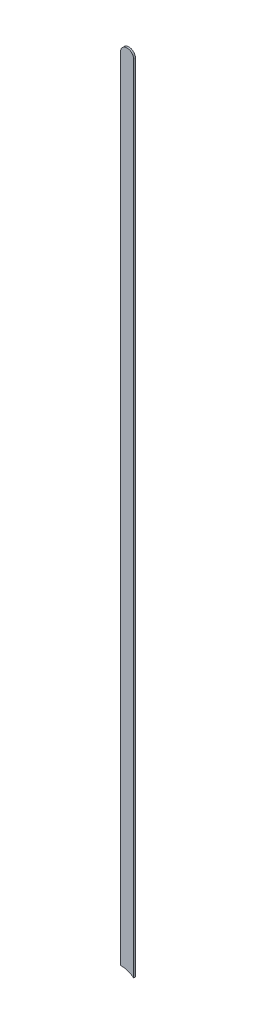
ISO-10303-21;
HEADER;
FILE_DESCRIPTION(('STEP AP214'),'2;1');
FILE_NAME('part.step','',(''),(''),'','','');
FILE_SCHEMA(('AUTOMOTIVE_DESIGN { 1 0 10303 214 1 1 1 1 }'));
ENDSEC;
DATA;
#1=APPLICATION_CONTEXT('core data for automotive mechanical design processes');
#2=APPLICATION_PROTOCOL_DEFINITION('international standard','automotive_design',2000,#1);
#3=PRODUCT_CONTEXT('',#1,'mechanical');
#4=PRODUCT('Part','Part','',(#3));
#5=PRODUCT_RELATED_PRODUCT_CATEGORY('part','',(#4));
#6=PRODUCT_DEFINITION_FORMATION('','',#4);
#7=PRODUCT_DEFINITION_CONTEXT('part definition',#1,'design');
#8=PRODUCT_DEFINITION('design','',#6,#7);
#9=PRODUCT_DEFINITION_SHAPE('','',#8);
#10=(LENGTH_UNIT() NAMED_UNIT(*) SI_UNIT(.MILLI.,.METRE.));
#11=(NAMED_UNIT(*) PLANE_ANGLE_UNIT() SI_UNIT($,.RADIAN.));
#12=(NAMED_UNIT(*) SI_UNIT($,.STERADIAN.) SOLID_ANGLE_UNIT());
#13=UNCERTAINTY_MEASURE_WITH_UNIT(LENGTH_MEASURE(1.E-05),#10,'distance_accuracy_value','');
#14=(GEOMETRIC_REPRESENTATION_CONTEXT(3) GLOBAL_UNCERTAINTY_ASSIGNED_CONTEXT((#13)) GLOBAL_UNIT_ASSIGNED_CONTEXT((#10,
#11,#12)) REPRESENTATION_CONTEXT('',''));
#15=CARTESIAN_POINT('',(0.,0.,0.));
#16=DIRECTION('',(0.,0.,1.));
#17=DIRECTION('',(1.,0.,0.));
#18=AXIS2_PLACEMENT_3D('',#15,#16,#17);
#19=CARTESIAN_POINT('',(87.64598422,72.6590111077274,0.));
#20=DIRECTION('',(-1.,0.,0.));
#21=DIRECTION('',(0.,1.,0.));
#22=AXIS2_PLACEMENT_3D('',#19,#20,#21);
#23=PLANE('',#22);
#24=DIRECTION('',(0.,1.,0.));
#25=VECTOR('',#24,1.);
#26=CARTESIAN_POINT('',(87.64598422,72.4889838,0.03556));
#27=LINE('',#26,#25);
#28=CARTESIAN_POINT('',(87.64598422,72.6590111077274,0.03556));
#29=VERTEX_POINT('',#28);
#30=CARTESIAN_POINT('',(87.64598422,88.05171874,0.03556));
#31=VERTEX_POINT('',#30);
#32=EDGE_CURVE('E11',#29,#31,#27,.T.);
#33=ORIENTED_EDGE('',*,*,#32,.F.);
#34=DIRECTION('',(0.,0.,1.));
#35=VECTOR('',#34,1.);
#36=CARTESIAN_POINT('',(87.64598422,72.6590111077274,0.));
#37=LINE('',#36,#35);
#38=CARTESIAN_POINT('',(87.64598422,72.6590111077274,0.));
#39=VERTEX_POINT('',#38);
#40=EDGE_CURVE('E24',#39,#29,#37,.T.);
#41=ORIENTED_EDGE('',*,*,#40,.F.);
#42=DIRECTION('',(0.,1.,0.));
#43=VECTOR('',#42,1.);
#44=CARTESIAN_POINT('',(87.64598422,72.4889838,0.));
#45=LINE('',#44,#43);
#46=CARTESIAN_POINT('',(87.64598422,88.05171874,0.));
#47=VERTEX_POINT('',#46);
#48=EDGE_CURVE('E75',#39,#47,#45,.T.);
#49=ORIENTED_EDGE('',*,*,#48,.T.);
#50=DIRECTION('',(0.,0.,1.));
#51=VECTOR('',#50,1.);
#52=CARTESIAN_POINT('',(87.64598422,88.05171874,0.));
#53=LINE('',#52,#51);
#54=EDGE_CURVE('E37',#47,#31,#53,.T.);
#55=ORIENTED_EDGE('',*,*,#54,.T.);
#56=EDGE_LOOP('',(#33,#41,#49,#55));
#57=FACE_BOUND('',#56,.T.);
#58=ADVANCED_FACE('F17',(#57),#23,.F.);
#59=CARTESIAN_POINT('',(87.51898422,88.05171874,0.));
#60=DIRECTION('',(0.,0.,-1.));
#61=DIRECTION('',(1.,1.1189649382048E-13,0.));
#62=AXIS2_PLACEMENT_3D('',#59,#60,#61);
#63=CYLINDRICAL_SURFACE('',#62,0.127000000000005);
#64=CARTESIAN_POINT('',(87.51898422,88.05171874,0.03556));
#65=DIRECTION('',(0.,0.,1.));
#66=DIRECTION('',(1.,1.1189649382048E-13,0.));
#67=AXIS2_PLACEMENT_3D('',#64,#65,#66);
#68=CIRCLE('',#67,0.127000000000005);
#69=CARTESIAN_POINT('',(87.39198422,88.05171874,0.03556));
#70=VERTEX_POINT('',#69);
#71=EDGE_CURVE('E83',#31,#70,#68,.T.);
#72=ORIENTED_EDGE('',*,*,#71,.F.);
#73=ORIENTED_EDGE('',*,*,#54,.F.);
#74=CARTESIAN_POINT('',(87.51898422,88.05171874,0.));
#75=DIRECTION('',(0.,0.,1.));
#76=DIRECTION('',(1.,1.1189649382048E-13,0.));
#77=AXIS2_PLACEMENT_3D('',#74,#75,#76);
#78=CIRCLE('',#77,0.127000000000005);
#79=CARTESIAN_POINT('',(87.39198422,88.05171874,0.));
#80=VERTEX_POINT('',#79);
#81=EDGE_CURVE('E81',#47,#80,#78,.T.);
#82=ORIENTED_EDGE('',*,*,#81,.T.);
#83=DIRECTION('',(0.,0.,1.));
#84=VECTOR('',#83,1.);
#85=CARTESIAN_POINT('',(87.39198422,88.05171874,0.));
#86=LINE('',#85,#84);
#87=EDGE_CURVE('E67',#80,#70,#86,.T.);
#88=ORIENTED_EDGE('',*,*,#87,.T.);
#89=EDGE_LOOP('',(#72,#73,#82,#88));
#90=FACE_BOUND('',#89,.T.);
#91=ADVANCED_FACE('F89',(#90),#63,.T.);
#92=CARTESIAN_POINT('',(87.39198422,88.05171874,0.));
#93=DIRECTION('',(1.,0.,0.));
#94=DIRECTION('',(0.,-1.,0.));
#95=AXIS2_PLACEMENT_3D('',#92,#93,#94);
#96=PLANE('',#95);
#97=DIRECTION('',(0.,-1.,0.));
#98=VECTOR('',#97,1.);
#99=CARTESIAN_POINT('',(87.39198422,88.05171874,0.03556));
#100=LINE('',#99,#98);
#101=CARTESIAN_POINT('',(87.39198422,72.7416932439222,0.03556));
#102=VERTEX_POINT('',#101);
#103=EDGE_CURVE('E71',#70,#102,#100,.T.);
#104=ORIENTED_EDGE('',*,*,#103,.F.);
#105=ORIENTED_EDGE('',*,*,#87,.F.);
#106=DIRECTION('',(0.,-1.,0.));
#107=VECTOR('',#106,1.);
#108=CARTESIAN_POINT('',(87.39198422,88.05171874,0.));
#109=LINE('',#108,#107);
#110=CARTESIAN_POINT('',(87.39198422,72.7416932439222,0.));
#111=VERTEX_POINT('',#110);
#112=EDGE_CURVE('E63',#80,#111,#109,.T.);
#113=ORIENTED_EDGE('',*,*,#112,.T.);
#114=DIRECTION('',(0.,0.,1.));
#115=VECTOR('',#114,1.);
#116=CARTESIAN_POINT('',(87.39198422,72.7416932439222,0.));
#117=LINE('',#116,#115);
#118=EDGE_CURVE('E53',#111,#102,#117,.T.);
#119=ORIENTED_EDGE('',*,*,#118,.T.);
#120=EDGE_LOOP('',(#104,#105,#113,#119));
#121=FACE_BOUND('',#120,.T.);
#122=ADVANCED_FACE('F66',(#121),#96,.F.);
#123=CARTESIAN_POINT('',(87.41697274,72.38697232,0.));
#124=DIRECTION('',(0.,0.,-1.));
#125=DIRECTION('',(1.,0.,0.));
#126=AXIS2_PLACEMENT_3D('',#123,#124,#125);
#127=CYLINDRICAL_SURFACE('',#126,0.3556);
#128=ORIENTED_EDGE('',*,*,#40,.T.);
#129=CARTESIAN_POINT('',(87.41697274,72.38697232,0.03556));
#130=DIRECTION('',(0.,0.,1.));
#131=DIRECTION('',(1.,0.,0.));
#132=AXIS2_PLACEMENT_3D('',#129,#130,#131);
#133=CIRCLE('',#132,0.3556);
#134=EDGE_CURVE('E59',#29,#102,#133,.T.);
#135=ORIENTED_EDGE('',*,*,#134,.T.);
#136=ORIENTED_EDGE('',*,*,#118,.F.);
#137=CARTESIAN_POINT('',(87.41697274,72.38697232,0.));
#138=DIRECTION('',(0.,0.,1.));
#139=DIRECTION('',(1.,0.,0.));
#140=AXIS2_PLACEMENT_3D('',#137,#138,#139);
#141=CIRCLE('',#140,0.3556);
#142=EDGE_CURVE('E57',#39,#111,#141,.T.);
#143=ORIENTED_EDGE('',*,*,#142,.F.);
#144=EDGE_LOOP('',(#128,#135,#136,#143));
#145=FACE_BOUND('',#144,.T.);
#146=ADVANCED_FACE('F55',(#145),#127,.F.);
#147=CARTESIAN_POINT('',(87.64598422,72.4889838,0.));
#148=DIRECTION('',(0.,0.,-1.));
#149=DIRECTION('',(-1.,0.,0.));
#150=AXIS2_PLACEMENT_3D('',#147,#148,#149);
#151=PLANE('',#150);
#152=ORIENTED_EDGE('',*,*,#48,.F.);
#153=ORIENTED_EDGE('',*,*,#142,.T.);
#154=ORIENTED_EDGE('',*,*,#112,.F.);
#155=ORIENTED_EDGE('',*,*,#81,.F.);
#156=EDGE_LOOP('',(#152,#153,#154,#155));
#157=FACE_BOUND('',#156,.T.);
#158=ADVANCED_FACE('F74',(#157),#151,.T.);
#159=CARTESIAN_POINT('',(87.64598422,72.4889838,0.03556));
#160=DIRECTION('',(0.,0.,-1.));
#161=DIRECTION('',(-1.,0.,0.));
#162=AXIS2_PLACEMENT_3D('',#159,#160,#161);
#163=PLANE('',#162);
#164=ORIENTED_EDGE('',*,*,#134,.F.);
#165=ORIENTED_EDGE('',*,*,#32,.T.);
#166=ORIENTED_EDGE('',*,*,#71,.T.);
#167=ORIENTED_EDGE('',*,*,#103,.T.);
#168=EDGE_LOOP('',(#164,#165,#166,#167));
#169=FACE_BOUND('',#168,.T.);
#170=ADVANCED_FACE('F91',(#169),#163,.F.);
#171=CLOSED_SHELL('',(#58,#91,#122,#146,#158,#170));
#172=MANIFOLD_SOLID_BREP('B1',#171);
#173=ADVANCED_BREP_SHAPE_REPRESENTATION('',(#18,#172),#14);
#174=SHAPE_DEFINITION_REPRESENTATION(#9,#173);
ENDSEC;
END-ISO-10303-21;
